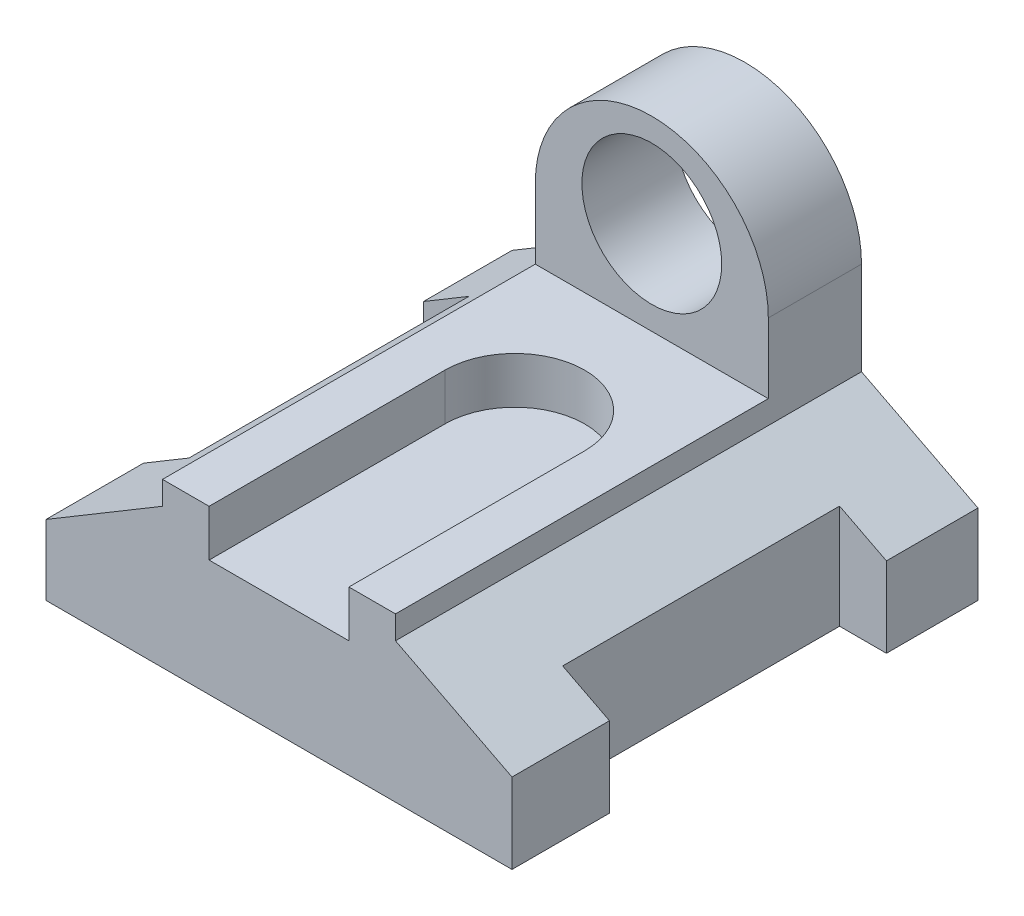
ISO-10303-21;
HEADER;
FILE_DESCRIPTION(('STEP AP214'),'2;1');
FILE_NAME('part.step','',(''),(''),'','','');
FILE_SCHEMA(('AUTOMOTIVE_DESIGN { 1 0 10303 214 1 1 1 1 }'));
ENDSEC;
DATA;
#1=APPLICATION_CONTEXT('core data for automotive mechanical design processes');
#2=APPLICATION_PROTOCOL_DEFINITION('international standard','automotive_design',2000,#1);
#3=PRODUCT_CONTEXT('',#1,'mechanical');
#4=PRODUCT('Part','Part','',(#3));
#5=PRODUCT_RELATED_PRODUCT_CATEGORY('part','',(#4));
#6=PRODUCT_DEFINITION_FORMATION('','',#4);
#7=PRODUCT_DEFINITION_CONTEXT('part definition',#1,'design');
#8=PRODUCT_DEFINITION('design','',#6,#7);
#9=PRODUCT_DEFINITION_SHAPE('','',#8);
#10=(LENGTH_UNIT() NAMED_UNIT(*) SI_UNIT(.MILLI.,.METRE.));
#11=(NAMED_UNIT(*) PLANE_ANGLE_UNIT() SI_UNIT($,.RADIAN.));
#12=(NAMED_UNIT(*) SI_UNIT($,.STERADIAN.) SOLID_ANGLE_UNIT());
#13=UNCERTAINTY_MEASURE_WITH_UNIT(LENGTH_MEASURE(1.E-05),#10,'distance_accuracy_value','');
#14=(GEOMETRIC_REPRESENTATION_CONTEXT(3) GLOBAL_UNCERTAINTY_ASSIGNED_CONTEXT((#13)) GLOBAL_UNIT_ASSIGNED_CONTEXT((#10,
#11,#12)) REPRESENTATION_CONTEXT('',''));
#15=CARTESIAN_POINT('',(0.,0.,0.));
#16=DIRECTION('',(0.,0.,1.));
#17=DIRECTION('',(1.,0.,0.));
#18=AXIS2_PLACEMENT_3D('',#15,#16,#17);
#19=CARTESIAN_POINT('',(63.7755102040816,9.43877551020408,100.));
#20=DIRECTION('',(-1.,0.,0.));
#21=DIRECTION('',(0.,-1.,0.));
#22=AXIS2_PLACEMENT_3D('',#19,#20,#21);
#23=PLANE('',#22);
#24=DIRECTION('',(0.,1.,0.));
#25=VECTOR('',#24,1.);
#26=CARTESIAN_POINT('',(63.7755102040816,9.43877551020408,0.));
#27=LINE('',#26,#25);
#28=CARTESIAN_POINT('',(63.7755102040816,-20.5612244897959,0.));
#29=VERTEX_POINT('',#28);
#30=CARTESIAN_POINT('',(63.7755102040816,-3.38012417465493,0.));
#31=VERTEX_POINT('',#30);
#32=EDGE_CURVE('E214',#29,#31,#27,.T.);
#33=ORIENTED_EDGE('',*,*,#32,.T.);
#34=DIRECTION('',(0.,0.,1.));
#35=VECTOR('',#34,1.);
#36=CARTESIAN_POINT('',(63.7755102040816,-3.38012417465493,100.));
#37=LINE('',#36,#35);
#38=CARTESIAN_POINT('',(63.7755102040816,-3.38012417465492,19.6515209700574));
#39=VERTEX_POINT('',#38);
#40=EDGE_CURVE('E267',#31,#39,#37,.T.);
#41=ORIENTED_EDGE('',*,*,#40,.T.);
#42=DIRECTION('',(0.,1.,0.));
#43=VECTOR('',#42,1.);
#44=CARTESIAN_POINT('',(63.7755102040816,-20.5612244897959,19.6515209700574));
#45=LINE('',#44,#43);
#46=CARTESIAN_POINT('',(63.7755102040816,-20.5612244897959,19.6515209700574));
#47=VERTEX_POINT('',#46);
#48=EDGE_CURVE('E269',#47,#39,#45,.T.);
#49=ORIENTED_EDGE('',*,*,#48,.F.);
#50=DIRECTION('',(0.,0.,-1.));
#51=VECTOR('',#50,1.);
#52=CARTESIAN_POINT('',(63.7755102040816,-20.5612244897959,100.));
#53=LINE('',#52,#51);
#54=EDGE_CURVE('E230',#47,#29,#53,.T.);
#55=ORIENTED_EDGE('',*,*,#54,.T.);
#56=EDGE_LOOP('',(#33,#41,#49,#55));
#57=FACE_BOUND('',#56,.T.);
#58=ADVANCED_FACE('F41',(#57),#23,.F.);
#59=DIRECTION('',(0.,1.,0.));
#60=VECTOR('',#59,1.);
#61=CARTESIAN_POINT('',(63.7755102040816,-20.5612244897959,79.0762357605909));
#62=LINE('',#61,#60);
#63=CARTESIAN_POINT('',(63.7755102040816,-20.5612244897959,79.0762357605909));
#64=VERTEX_POINT('',#63);
#65=CARTESIAN_POINT('',(63.7755102040816,-3.38012417465492,79.0762357605909));
#66=VERTEX_POINT('',#65);
#67=EDGE_CURVE('E285',#64,#66,#62,.T.);
#68=ORIENTED_EDGE('',*,*,#67,.T.);
#69=DIRECTION('',(0.,0.,1.));
#70=VECTOR('',#69,1.);
#71=CARTESIAN_POINT('',(63.7755102040816,-3.38012417465493,100.));
#72=LINE('',#71,#70);
#73=CARTESIAN_POINT('',(63.7755102040816,-3.38012417465493,100.));
#74=VERTEX_POINT('',#73);
#75=EDGE_CURVE('E460',#66,#74,#72,.T.);
#76=ORIENTED_EDGE('',*,*,#75,.T.);
#77=DIRECTION('',(0.,1.,0.));
#78=VECTOR('',#77,1.);
#79=CARTESIAN_POINT('',(63.7755102040816,9.43877551020408,100.));
#80=LINE('',#79,#78);
#81=CARTESIAN_POINT('',(63.7755102040816,-20.5612244897959,100.));
#82=VERTEX_POINT('',#81);
#83=EDGE_CURVE('E218',#82,#74,#80,.T.);
#84=ORIENTED_EDGE('',*,*,#83,.F.);
#85=EDGE_CURVE('E237',#82,#64,#53,.T.);
#86=ORIENTED_EDGE('',*,*,#85,.T.);
#87=EDGE_LOOP('',(#68,#76,#84,#86));
#88=FACE_BOUND('',#87,.T.);
#89=ADVANCED_FACE('F414',(#88),#23,.F.);
#90=CARTESIAN_POINT('',(0.,0.,100.));
#91=DIRECTION('',(0.,0.,1.));
#92=DIRECTION('',(1.,0.,0.));
#93=AXIS2_PLACEMENT_3D('',#90,#91,#92);
#94=PLANE('',#93);
#95=DIRECTION('',(0.85829371120847,0.513158752531799,0.));
#96=VECTOR('',#95,1.);
#97=CARTESIAN_POINT('',(-11.2244897959184,9.43877551020409,100.));
#98=LINE('',#97,#96);
#99=CARTESIAN_POINT('',(-36.2244897959184,-5.50828590450895,100.));
#100=VERTEX_POINT('',#99);
#101=CARTESIAN_POINT('',(-11.2244897959184,9.43877551020409,100.));
#102=VERTEX_POINT('',#101);
#103=EDGE_CURVE('E191',#100,#102,#98,.T.);
#104=ORIENTED_EDGE('',*,*,#103,.F.);
#105=DIRECTION('',(0.,-1.,0.));
#106=VECTOR('',#105,1.);
#107=CARTESIAN_POINT('',(-36.2244897959184,9.43877551020408,100.));
#108=LINE('',#107,#106);
#109=CARTESIAN_POINT('',(-36.2244897959184,-20.5612244897959,100.));
#110=VERTEX_POINT('',#109);
#111=EDGE_CURVE('E203',#100,#110,#108,.T.);
#112=ORIENTED_EDGE('',*,*,#111,.T.);
#113=DIRECTION('',(1.,0.,0.));
#114=VECTOR('',#113,1.);
#115=CARTESIAN_POINT('',(-36.2244897959184,-20.5612244897959,100.));
#116=LINE('',#115,#114);
#117=EDGE_CURVE('E213',#110,#82,#116,.T.);
#118=ORIENTED_EDGE('',*,*,#117,.T.);
#119=ORIENTED_EDGE('',*,*,#83,.T.);
#120=DIRECTION('',(0.889840775309432,-0.456271185367551,0.));
#121=VECTOR('',#120,1.);
#122=CARTESIAN_POINT('',(67.925947804369,-5.50828590450895,100.));
#123=LINE('',#122,#121);
#124=CARTESIAN_POINT('',(38.7755102040816,9.43877551020408,100.));
#125=VERTEX_POINT('',#124);
#126=EDGE_CURVE('E208',#125,#74,#123,.T.);
#127=ORIENTED_EDGE('',*,*,#126,.F.);
#128=DIRECTION('',(0.,1.,0.));
#129=VECTOR('',#128,1.);
#130=CARTESIAN_POINT('',(38.7755102040816,0.,100.));
#131=LINE('',#130,#129);
#132=CARTESIAN_POINT('',(38.7755102040816,14.4387755102041,100.));
#133=VERTEX_POINT('',#132);
#134=EDGE_CURVE('E356',#125,#133,#131,.T.);
#135=ORIENTED_EDGE('',*,*,#134,.T.);
#136=DIRECTION('',(-1.,0.,0.));
#137=VECTOR('',#136,1.);
#138=CARTESIAN_POINT('',(0.,14.4387755102041,100.));
#139=LINE('',#138,#137);
#140=CARTESIAN_POINT('',(28.7755102040816,14.4387755102041,100.));
#141=VERTEX_POINT('',#140);
#142=EDGE_CURVE('E362',#133,#141,#139,.T.);
#143=ORIENTED_EDGE('',*,*,#142,.T.);
#144=DIRECTION('',(0.,1.,0.));
#145=VECTOR('',#144,1.);
#146=CARTESIAN_POINT('',(28.7755102040816,4.43877551020409,100.));
#147=LINE('',#146,#145);
#148=CARTESIAN_POINT('',(28.7755102040816,4.43877551020409,100.));
#149=VERTEX_POINT('',#148);
#150=EDGE_CURVE('E499',#149,#141,#147,.T.);
#151=ORIENTED_EDGE('',*,*,#150,.F.);
#152=DIRECTION('',(1.,0.,0.));
#153=VECTOR('',#152,1.);
#154=CARTESIAN_POINT('',(0.,4.43877551020409,100.));
#155=LINE('',#154,#153);
#156=CARTESIAN_POINT('',(-1.22448979591837,4.43877551020409,100.));
#157=VERTEX_POINT('',#156);
#158=EDGE_CURVE('E479',#157,#149,#155,.T.);
#159=ORIENTED_EDGE('',*,*,#158,.F.);
#160=DIRECTION('',(0.,1.,0.));
#161=VECTOR('',#160,1.);
#162=CARTESIAN_POINT('',(-1.22448979591837,4.43877551020409,100.));
#163=LINE('',#162,#161);
#164=CARTESIAN_POINT('',(-1.22448979591837,14.4387755102041,100.));
#165=VERTEX_POINT('',#164);
#166=EDGE_CURVE('E502',#157,#165,#163,.T.);
#167=ORIENTED_EDGE('',*,*,#166,.T.);
#168=CARTESIAN_POINT('',(-11.2244897959184,14.4387755102041,100.));
#169=VERTEX_POINT('',#168);
#170=EDGE_CURVE('E360',#165,#169,#139,.T.);
#171=ORIENTED_EDGE('',*,*,#170,.T.);
#172=DIRECTION('',(0.,1.,0.));
#173=VECTOR('',#172,1.);
#174=CARTESIAN_POINT('',(-11.2244897959184,0.,100.));
#175=LINE('',#174,#173);
#176=EDGE_CURVE('E206',#102,#169,#175,.T.);
#177=ORIENTED_EDGE('',*,*,#176,.F.);
#178=EDGE_LOOP('',(#104,#112,#118,#119,#127,#135,#143,#151,#159,#167,#171,#177));
#179=FACE_BOUND('',#178,.T.);
#180=ADVANCED_FACE('F202',(#179),#94,.T.);
#181=CARTESIAN_POINT('',(0.,0.,0.));
#182=DIRECTION('',(0.,0.,1.));
#183=DIRECTION('',(1.,0.,0.));
#184=AXIS2_PLACEMENT_3D('',#181,#182,#183);
#185=PLANE('',#184);
#186=CARTESIAN_POINT('',(13.7755102040816,34.4387755102041,0.));
#187=DIRECTION('',(0.,0.,1.));
#188=DIRECTION('',(1.,0.,0.));
#189=AXIS2_PLACEMENT_3D('',#186,#187,#188);
#190=CIRCLE('',#189,15.);
#191=CARTESIAN_POINT('',(28.7755102040816,34.4387755102041,0.));
#192=VERTEX_POINT('',#191);
#193=EDGE_CURVE('E322',#192,#192,#190,.T.);
#194=ORIENTED_EDGE('',*,*,#193,.T.);
#195=EDGE_LOOP('',(#194));
#196=FACE_BOUND('',#195,.T.);
#197=DIRECTION('',(0.,-1.,0.));
#198=VECTOR('',#197,1.);
#199=CARTESIAN_POINT('',(-36.2244897959184,9.43877551020408,0.));
#200=LINE('',#199,#198);
#201=CARTESIAN_POINT('',(-36.2244897959184,-5.50828590450895,0.));
#202=VERTEX_POINT('',#201);
#203=CARTESIAN_POINT('',(-36.2244897959184,-20.5612244897959,0.));
#204=VERTEX_POINT('',#203);
#205=EDGE_CURVE('E231',#202,#204,#200,.T.);
#206=ORIENTED_EDGE('',*,*,#205,.F.);
#207=DIRECTION('',(0.85829371120847,0.513158752531799,0.));
#208=VECTOR('',#207,1.);
#209=CARTESIAN_POINT('',(-7.11298934916731,11.8969694975724,0.));
#210=LINE('',#209,#208);
#211=CARTESIAN_POINT('',(-11.2244897959184,9.43877551020409,0.));
#212=VERTEX_POINT('',#211);
#213=EDGE_CURVE('E444',#202,#212,#210,.T.);
#214=ORIENTED_EDGE('',*,*,#213,.T.);
#215=DIRECTION('',(0.,1.,0.));
#216=VECTOR('',#215,1.);
#217=CARTESIAN_POINT('',(-11.2244897959184,0.,0.));
#218=LINE('',#217,#216);
#219=CARTESIAN_POINT('',(-11.2244897959184,29.4387755102041,0.));
#220=VERTEX_POINT('',#219);
#221=EDGE_CURVE('E361',#212,#220,#218,.T.);
#222=ORIENTED_EDGE('',*,*,#221,.T.);
#223=CARTESIAN_POINT('',(13.7755102040816,29.4387755102041,0.));
#224=DIRECTION('',(0.,0.,1.));
#225=DIRECTION('',(-1.,0.,0.));
#226=AXIS2_PLACEMENT_3D('',#223,#224,#225);
#227=CIRCLE('',#226,25.);
#228=CARTESIAN_POINT('',(38.7755102040816,29.4387755102041,0.));
#229=VERTEX_POINT('',#228);
#230=EDGE_CURVE('E326',#229,#220,#227,.T.);
#231=ORIENTED_EDGE('',*,*,#230,.F.);
#232=DIRECTION('',(0.,1.,0.));
#233=VECTOR('',#232,1.);
#234=CARTESIAN_POINT('',(38.7755102040816,0.,0.));
#235=LINE('',#234,#233);
#236=CARTESIAN_POINT('',(38.7755102040816,9.43877551020408,0.));
#237=VERTEX_POINT('',#236);
#238=EDGE_CURVE('E355',#237,#229,#235,.T.);
#239=ORIENTED_EDGE('',*,*,#238,.F.);
#240=DIRECTION('',(0.889840775309432,-0.456271185367551,0.));
#241=VECTOR('',#240,1.);
#242=CARTESIAN_POINT('',(11.9046423663867,23.2169738804647,0.));
#243=LINE('',#242,#241);
#244=EDGE_CURVE('E263',#237,#31,#243,.T.);
#245=ORIENTED_EDGE('',*,*,#244,.T.);
#246=ORIENTED_EDGE('',*,*,#32,.F.);
#247=DIRECTION('',(1.,0.,0.));
#248=VECTOR('',#247,1.);
#249=CARTESIAN_POINT('',(-36.2244897959184,-20.5612244897959,0.));
#250=LINE('',#249,#248);
#251=EDGE_CURVE('E221',#204,#29,#250,.T.);
#252=ORIENTED_EDGE('',*,*,#251,.F.);
#253=EDGE_LOOP('',(#206,#214,#222,#231,#239,#245,#246,#252));
#254=FACE_BOUND('',#253,.T.);
#255=ADVANCED_FACE('F259',(#196,#254),#185,.F.);
#256=CARTESIAN_POINT('',(53.7220228304721,-20.5612244897959,0.));
#257=DIRECTION('',(-1.,0.,0.));
#258=DIRECTION('',(0.,0.,1.));
#259=AXIS2_PLACEMENT_3D('',#256,#257,#258);
#260=PLANE('',#259);
#261=DIRECTION('',(0.,1.,0.));
#262=VECTOR('',#261,1.);
#263=CARTESIAN_POINT('',(53.7220228304721,-20.5612244897959,19.6515209700574));
#264=LINE('',#263,#262);
#265=CARTESIAN_POINT('',(53.7220228304721,-20.5612244897959,19.6515209700574));
#266=VERTEX_POINT('',#265);
#267=CARTESIAN_POINT('',(53.7220228304721,1.77486167035694,19.6515209700574));
#268=VERTEX_POINT('',#267);
#269=EDGE_CURVE('E290',#266,#268,#264,.T.);
#270=ORIENTED_EDGE('',*,*,#269,.T.);
#271=DIRECTION('',(0.,0.,1.));
#272=VECTOR('',#271,1.);
#273=CARTESIAN_POINT('',(53.7220228304721,1.77486167035694,0.));
#274=LINE('',#273,#272);
#275=CARTESIAN_POINT('',(53.7220228304721,1.77486167035695,79.0762357605909));
#276=VERTEX_POINT('',#275);
#277=EDGE_CURVE('E456',#268,#276,#274,.T.);
#278=ORIENTED_EDGE('',*,*,#277,.T.);
#279=DIRECTION('',(0.,1.,0.));
#280=VECTOR('',#279,1.);
#281=CARTESIAN_POINT('',(53.7220228304721,-20.5612244897959,79.0762357605909));
#282=LINE('',#281,#280);
#283=CARTESIAN_POINT('',(53.7220228304721,-20.5612244897959,79.0762357605909));
#284=VERTEX_POINT('',#283);
#285=EDGE_CURVE('E279',#284,#276,#282,.T.);
#286=ORIENTED_EDGE('',*,*,#285,.F.);
#287=DIRECTION('',(0.,0.,1.));
#288=VECTOR('',#287,1.);
#289=CARTESIAN_POINT('',(53.7220228304721,-20.5612244897959,0.));
#290=LINE('',#289,#288);
#291=EDGE_CURVE('E276',#266,#284,#290,.T.);
#292=ORIENTED_EDGE('',*,*,#291,.F.);
#293=EDGE_LOOP('',(#270,#278,#286,#292));
#294=FACE_BOUND('',#293,.T.);
#295=ADVANCED_FACE('F532',(#294),#260,.F.);
#296=CARTESIAN_POINT('',(0.,-20.5612244897959,19.6515209700574));
#297=DIRECTION('',(0.,0.,-1.));
#298=DIRECTION('',(-1.,0.,0.));
#299=AXIS2_PLACEMENT_3D('',#296,#297,#298);
#300=PLANE('',#299);
#301=ORIENTED_EDGE('',*,*,#48,.T.);
#302=DIRECTION('',(-0.889840775309432,0.456271185367551,0.));
#303=VECTOR('',#302,1.);
#304=CARTESIAN_POINT('',(20.2526785016695,18.936468369114,19.6515209700574));
#305=LINE('',#304,#303);
#306=EDGE_CURVE('E464',#39,#268,#305,.T.);
#307=ORIENTED_EDGE('',*,*,#306,.T.);
#308=ORIENTED_EDGE('',*,*,#269,.F.);
#309=DIRECTION('',(-1.,0.,0.));
#310=VECTOR('',#309,1.);
#311=CARTESIAN_POINT('',(0.,-20.5612244897959,19.6515209700574));
#312=LINE('',#311,#310);
#313=EDGE_CURVE('E273',#47,#266,#312,.T.);
#314=ORIENTED_EDGE('',*,*,#313,.F.);
#315=EDGE_LOOP('',(#301,#307,#308,#314));
#316=FACE_BOUND('',#315,.T.);
#317=ADVANCED_FACE('F435',(#316),#300,.F.);
#318=CARTESIAN_POINT('',(0.,-20.5612244897959,79.0762357605909));
#319=DIRECTION('',(0.,0.,1.));
#320=DIRECTION('',(1.,0.,0.));
#321=AXIS2_PLACEMENT_3D('',#318,#319,#320);
#322=PLANE('',#321);
#323=ORIENTED_EDGE('',*,*,#285,.T.);
#324=DIRECTION('',(0.889840775309432,-0.456271185367551,0.));
#325=VECTOR('',#324,1.);
#326=CARTESIAN_POINT('',(20.2526785016695,18.936468369114,79.0762357605909));
#327=LINE('',#326,#325);
#328=EDGE_CURVE('E448',#276,#66,#327,.T.);
#329=ORIENTED_EDGE('',*,*,#328,.T.);
#330=ORIENTED_EDGE('',*,*,#67,.F.);
#331=DIRECTION('',(1.,0.,0.));
#332=VECTOR('',#331,1.);
#333=CARTESIAN_POINT('',(0.,-20.5612244897959,79.0762357605909));
#334=LINE('',#333,#332);
#335=EDGE_CURVE('E280',#284,#64,#334,.T.);
#336=ORIENTED_EDGE('',*,*,#335,.F.);
#337=EDGE_LOOP('',(#323,#329,#330,#336));
#338=FACE_BOUND('',#337,.T.);
#339=ADVANCED_FACE('F431',(#338),#322,.F.);
#340=CARTESIAN_POINT('',(-36.2244897959184,9.43877551020408,100.));
#341=DIRECTION('',(1.,0.,0.));
#342=DIRECTION('',(0.,1.,0.));
#343=AXIS2_PLACEMENT_3D('',#340,#341,#342);
#344=PLANE('',#343);
#345=DIRECTION('',(0.,1.,0.));
#346=VECTOR('',#345,1.);
#347=CARTESIAN_POINT('',(-36.2244897959184,-20.5612244897959,18.9953724311174));
#348=LINE('',#347,#346);
#349=CARTESIAN_POINT('',(-36.2244897959184,-20.5612244897959,18.9953724311174));
#350=VERTEX_POINT('',#349);
#351=CARTESIAN_POINT('',(-36.2244897959184,-5.50828590450895,18.9953724311174));
#352=VERTEX_POINT('',#351);
#353=EDGE_CURVE('E307',#350,#352,#348,.T.);
#354=ORIENTED_EDGE('',*,*,#353,.T.);
#355=DIRECTION('',(0.,0.,1.));
#356=VECTOR('',#355,1.);
#357=CARTESIAN_POINT('',(-36.2244897959184,-5.50828590450895,-30.));
#358=LINE('',#357,#356);
#359=EDGE_CURVE('E198',#202,#352,#358,.T.);
#360=ORIENTED_EDGE('',*,*,#359,.F.);
#361=ORIENTED_EDGE('',*,*,#205,.T.);
#362=DIRECTION('',(0.,0.,-1.));
#363=VECTOR('',#362,1.);
#364=CARTESIAN_POINT('',(-36.2244897959184,-20.5612244897959,100.));
#365=LINE('',#364,#363);
#366=EDGE_CURVE('E240',#350,#204,#365,.T.);
#367=ORIENTED_EDGE('',*,*,#366,.F.);
#368=EDGE_LOOP('',(#354,#360,#361,#367));
#369=FACE_BOUND('',#368,.T.);
#370=ADVANCED_FACE('F426',(#369),#344,.F.);
#371=CARTESIAN_POINT('',(0.,14.4387755102041,100.));
#372=DIRECTION('',(0.,-1.,0.));
#373=DIRECTION('',(0.,0.,-1.));
#374=AXIS2_PLACEMENT_3D('',#371,#372,#373);
#375=PLANE('',#374);
#376=CARTESIAN_POINT('',(13.7755102040816,14.4387755102041,49.395873987919));
#377=DIRECTION('',(0.,1.,0.));
#378=DIRECTION('',(0.,0.,1.));
#379=AXIS2_PLACEMENT_3D('',#376,#377,#378);
#380=CIRCLE('',#379,15.);
#381=CARTESIAN_POINT('',(-1.22448979591837,14.4387755102041,49.395873987919));
#382=VERTEX_POINT('',#381);
#383=CARTESIAN_POINT('',(28.7755102040816,14.4387755102041,49.395873987919));
#384=VERTEX_POINT('',#383);
#385=EDGE_CURVE('E472',#382,#384,#380,.F.);
#386=ORIENTED_EDGE('',*,*,#385,.T.);
#387=DIRECTION('',(0.,0.,-1.));
#388=VECTOR('',#387,1.);
#389=CARTESIAN_POINT('',(28.7755102040816,14.4387755102041,0.));
#390=LINE('',#389,#388);
#391=EDGE_CURVE('E476',#141,#384,#390,.T.);
#392=ORIENTED_EDGE('',*,*,#391,.F.);
#393=ORIENTED_EDGE('',*,*,#142,.F.);
#394=DIRECTION('',(0.,0.,-1.));
#395=VECTOR('',#394,1.);
#396=CARTESIAN_POINT('',(38.7755102040816,14.4387755102041,100.));
#397=LINE('',#396,#395);
#398=CARTESIAN_POINT('',(38.7755102040816,14.4387755102041,20.));
#399=VERTEX_POINT('',#398);
#400=EDGE_CURVE('E224',#133,#399,#397,.T.);
#401=ORIENTED_EDGE('',*,*,#400,.T.);
#402=DIRECTION('',(1.,0.,0.));
#403=VECTOR('',#402,1.);
#404=CARTESIAN_POINT('',(-11.2244897959184,14.4387755102041,20.));
#405=LINE('',#404,#403);
#406=CARTESIAN_POINT('',(-11.2244897959184,14.4387755102041,20.));
#407=VERTEX_POINT('',#406);
#408=EDGE_CURVE('E334',#407,#399,#405,.T.);
#409=ORIENTED_EDGE('',*,*,#408,.F.);
#410=DIRECTION('',(0.,0.,-1.));
#411=VECTOR('',#410,1.);
#412=CARTESIAN_POINT('',(-11.2244897959184,14.4387755102041,100.));
#413=LINE('',#412,#411);
#414=EDGE_CURVE('E378',#169,#407,#413,.T.);
#415=ORIENTED_EDGE('',*,*,#414,.F.);
#416=ORIENTED_EDGE('',*,*,#170,.F.);
#417=DIRECTION('',(0.,0.,-1.));
#418=VECTOR('',#417,1.);
#419=CARTESIAN_POINT('',(-1.22448979591837,14.4387755102041,0.));
#420=LINE('',#419,#418);
#421=EDGE_CURVE('E489',#165,#382,#420,.T.);
#422=ORIENTED_EDGE('',*,*,#421,.T.);
#423=EDGE_LOOP('',(#386,#392,#393,#401,#409,#415,#416,#422));
#424=FACE_BOUND('',#423,.T.);
#425=ADVANCED_FACE('F388',(#424),#375,.F.);
#426=ORIENTED_EDGE('',*,*,#111,.F.);
#427=CARTESIAN_POINT('',(-36.2244897959184,-5.50828590450895,79.0762357605909));
#428=VERTEX_POINT('',#427);
#429=EDGE_CURVE('E188',#428,#100,#358,.T.);
#430=ORIENTED_EDGE('',*,*,#429,.F.);
#431=DIRECTION('',(0.,1.,0.));
#432=VECTOR('',#431,1.);
#433=CARTESIAN_POINT('',(-36.2244897959184,-20.5612244897959,79.0762357605909));
#434=LINE('',#433,#432);
#435=CARTESIAN_POINT('',(-36.2244897959184,-20.5612244897959,79.0762357605909));
#436=VERTEX_POINT('',#435);
#437=EDGE_CURVE('E317',#436,#428,#434,.T.);
#438=ORIENTED_EDGE('',*,*,#437,.F.);
#439=EDGE_CURVE('E50',#110,#436,#365,.T.);
#440=ORIENTED_EDGE('',*,*,#439,.F.);
#441=EDGE_LOOP('',(#426,#430,#438,#440));
#442=FACE_BOUND('',#441,.T.);
#443=ADVANCED_FACE('F43',(#442),#344,.F.);
#444=CARTESIAN_POINT('',(-36.2244897959184,-20.5612244897959,100.));
#445=DIRECTION('',(0.,1.,0.));
#446=DIRECTION('',(0.,0.,1.));
#447=AXIS2_PLACEMENT_3D('',#444,#445,#446);
#448=PLANE('',#447);
#449=ORIENTED_EDGE('',*,*,#54,.F.);
#450=ORIENTED_EDGE('',*,*,#313,.T.);
#451=ORIENTED_EDGE('',*,*,#291,.T.);
#452=ORIENTED_EDGE('',*,*,#335,.T.);
#453=ORIENTED_EDGE('',*,*,#85,.F.);
#454=ORIENTED_EDGE('',*,*,#117,.F.);
#455=ORIENTED_EDGE('',*,*,#439,.T.);
#456=DIRECTION('',(1.,0.,0.));
#457=VECTOR('',#456,1.);
#458=CARTESIAN_POINT('',(-36.2244897959184,-20.5612244897959,79.0762357605909));
#459=LINE('',#458,#457);
#460=CARTESIAN_POINT('',(-26.4701524690782,-20.5612244897959,79.0762357605909));
#461=VERTEX_POINT('',#460);
#462=EDGE_CURVE('E301',#436,#461,#459,.T.);
#463=ORIENTED_EDGE('',*,*,#462,.T.);
#464=DIRECTION('',(0.,0.,-1.));
#465=VECTOR('',#464,1.);
#466=CARTESIAN_POINT('',(-26.4701524690782,-20.5612244897959,79.0762357605909));
#467=LINE('',#466,#465);
#468=CARTESIAN_POINT('',(-26.4701524690782,-20.5612244897959,18.9953724311174));
#469=VERTEX_POINT('',#468);
#470=EDGE_CURVE('E304',#461,#469,#467,.T.);
#471=ORIENTED_EDGE('',*,*,#470,.T.);
#472=DIRECTION('',(-1.,0.,0.));
#473=VECTOR('',#472,1.);
#474=CARTESIAN_POINT('',(-26.4701524690782,-20.5612244897959,18.9953724311174));
#475=LINE('',#474,#473);
#476=EDGE_CURVE('E254',#469,#350,#475,.T.);
#477=ORIENTED_EDGE('',*,*,#476,.T.);
#478=ORIENTED_EDGE('',*,*,#366,.T.);
#479=ORIENTED_EDGE('',*,*,#251,.T.);
#480=EDGE_LOOP('',(#449,#450,#451,#452,#453,#454,#455,#463,#471,#477,#478,#479));
#481=FACE_BOUND('',#480,.T.);
#482=ADVANCED_FACE('F250',(#481),#448,.F.);
#483=CARTESIAN_POINT('',(38.7755102040816,0.,100.));
#484=DIRECTION('',(-1.,0.,0.));
#485=DIRECTION('',(0.,0.,1.));
#486=AXIS2_PLACEMENT_3D('',#483,#484,#485);
#487=PLANE('',#486);
#488=ORIENTED_EDGE('',*,*,#238,.T.);
#489=DIRECTION('',(0.,0.,-1.));
#490=VECTOR('',#489,1.);
#491=CARTESIAN_POINT('',(38.7755102040816,29.4387755102041,20.));
#492=LINE('',#491,#490);
#493=CARTESIAN_POINT('',(38.7755102040816,29.4387755102041,20.));
#494=VERTEX_POINT('',#493);
#495=EDGE_CURVE('E351',#494,#229,#492,.T.);
#496=ORIENTED_EDGE('',*,*,#495,.F.);
#497=DIRECTION('',(0.,1.,0.));
#498=VECTOR('',#497,1.);
#499=CARTESIAN_POINT('',(38.7755102040816,14.4387755102041,20.));
#500=LINE('',#499,#498);
#501=EDGE_CURVE('E338',#399,#494,#500,.T.);
#502=ORIENTED_EDGE('',*,*,#501,.F.);
#503=ORIENTED_EDGE('',*,*,#400,.F.);
#504=ORIENTED_EDGE('',*,*,#134,.F.);
#505=DIRECTION('',(0.,0.,-1.));
#506=VECTOR('',#505,1.);
#507=CARTESIAN_POINT('',(38.7755102040816,9.43877551020408,100.));
#508=LINE('',#507,#506);
#509=EDGE_CURVE('E368',#125,#237,#508,.T.);
#510=ORIENTED_EDGE('',*,*,#509,.T.);
#511=EDGE_LOOP('',(#488,#496,#502,#503,#504,#510));
#512=FACE_BOUND('',#511,.T.);
#513=ADVANCED_FACE('F396',(#512),#487,.F.);
#514=CARTESIAN_POINT('',(-11.2244897959184,0.,100.));
#515=DIRECTION('',(-1.,0.,0.));
#516=DIRECTION('',(0.,0.,1.));
#517=AXIS2_PLACEMENT_3D('',#514,#515,#516);
#518=PLANE('',#517);
#519=ORIENTED_EDGE('',*,*,#221,.F.);
#520=DIRECTION('',(0.,0.,-1.));
#521=VECTOR('',#520,1.);
#522=CARTESIAN_POINT('',(-11.2244897959184,9.43877551020409,100.));
#523=LINE('',#522,#521);
#524=EDGE_CURVE('E376',#102,#212,#523,.T.);
#525=ORIENTED_EDGE('',*,*,#524,.F.);
#526=ORIENTED_EDGE('',*,*,#176,.T.);
#527=ORIENTED_EDGE('',*,*,#414,.T.);
#528=DIRECTION('',(0.,-1.,0.));
#529=VECTOR('',#528,1.);
#530=CARTESIAN_POINT('',(-11.2244897959184,14.4387755102041,20.));
#531=LINE('',#530,#529);
#532=CARTESIAN_POINT('',(-11.2244897959184,29.4387755102041,20.));
#533=VERTEX_POINT('',#532);
#534=EDGE_CURVE('E330',#533,#407,#531,.T.);
#535=ORIENTED_EDGE('',*,*,#534,.F.);
#536=DIRECTION('',(0.,0.,-1.));
#537=VECTOR('',#536,1.);
#538=CARTESIAN_POINT('',(-11.2244897959184,29.4387755102041,20.));
#539=LINE('',#538,#537);
#540=EDGE_CURVE('E344',#533,#220,#539,.T.);
#541=ORIENTED_EDGE('',*,*,#540,.T.);
#542=EDGE_LOOP('',(#519,#525,#526,#527,#535,#541));
#543=FACE_BOUND('',#542,.T.);
#544=ADVANCED_FACE('F403',(#543),#518,.T.);
#545=CARTESIAN_POINT('',(13.7755102040816,29.4387755102041,20.));
#546=DIRECTION('',(0.,0.,-1.));
#547=DIRECTION('',(-1.,0.,0.));
#548=AXIS2_PLACEMENT_3D('',#545,#546,#547);
#549=CYLINDRICAL_SURFACE('',#548,25.);
#550=ORIENTED_EDGE('',*,*,#230,.T.);
#551=ORIENTED_EDGE('',*,*,#540,.F.);
#552=CARTESIAN_POINT('',(13.7755102040816,29.4387755102041,20.));
#553=DIRECTION('',(0.,0.,1.));
#554=DIRECTION('',(-1.,0.,0.));
#555=AXIS2_PLACEMENT_3D('',#552,#553,#554);
#556=CIRCLE('',#555,25.);
#557=EDGE_CURVE('E341',#494,#533,#556,.T.);
#558=ORIENTED_EDGE('',*,*,#557,.F.);
#559=ORIENTED_EDGE('',*,*,#495,.T.);
#560=EDGE_LOOP('',(#550,#551,#558,#559));
#561=FACE_BOUND('',#560,.T.);
#562=ADVANCED_FACE('F401',(#561),#549,.T.);
#563=CARTESIAN_POINT('',(13.7755102040816,29.4387755102041,20.));
#564=DIRECTION('',(0.,0.,-1.));
#565=DIRECTION('',(-1.,0.,0.));
#566=AXIS2_PLACEMENT_3D('',#563,#564,#565);
#567=PLANE('',#566);
#568=CARTESIAN_POINT('',(13.7755102040816,34.4387755102041,20.));
#569=DIRECTION('',(0.,0.,1.));
#570=DIRECTION('',(1.,0.,0.));
#571=AXIS2_PLACEMENT_3D('',#568,#569,#570);
#572=CIRCLE('',#571,15.);
#573=CARTESIAN_POINT('',(28.7755102040816,34.4387755102041,20.));
#574=VERTEX_POINT('',#573);
#575=EDGE_CURVE('E312',#574,#574,#572,.T.);
#576=ORIENTED_EDGE('',*,*,#575,.F.);
#577=EDGE_LOOP('',(#576));
#578=FACE_BOUND('',#577,.T.);
#579=ORIENTED_EDGE('',*,*,#534,.T.);
#580=ORIENTED_EDGE('',*,*,#408,.T.);
#581=ORIENTED_EDGE('',*,*,#501,.T.);
#582=ORIENTED_EDGE('',*,*,#557,.T.);
#583=EDGE_LOOP('',(#579,#580,#581,#582));
#584=FACE_BOUND('',#583,.T.);
#585=ADVANCED_FACE('F394',(#578,#584),#567,.F.);
#586=CARTESIAN_POINT('',(13.7755102040816,34.4387755102041,0.));
#587=DIRECTION('',(0.,0.,1.));
#588=DIRECTION('',(1.,0.,0.));
#589=AXIS2_PLACEMENT_3D('',#586,#587,#588);
#590=CYLINDRICAL_SURFACE('',#589,15.);
#591=ORIENTED_EDGE('',*,*,#193,.F.);
#592=EDGE_LOOP('',(#591));
#593=FACE_BOUND('',#592,.T.);
#594=ORIENTED_EDGE('',*,*,#575,.T.);
#595=EDGE_LOOP('',(#594));
#596=FACE_BOUND('',#595,.T.);
#597=ADVANCED_FACE('F552',(#593,#596),#590,.F.);
#598=CARTESIAN_POINT('',(-26.4701524690782,-20.5612244897959,18.9953724311174));
#599=DIRECTION('',(0.,0.,-1.));
#600=DIRECTION('',(-1.,0.,0.));
#601=AXIS2_PLACEMENT_3D('',#598,#599,#600);
#602=PLANE('',#601);
#603=DIRECTION('',(0.,1.,0.));
#604=VECTOR('',#603,1.);
#605=CARTESIAN_POINT('',(-26.4701524690782,-20.5612244897959,18.9953724311174));
#606=LINE('',#605,#604);
#607=CARTESIAN_POINT('',(-26.4701524690782,0.323661258855367,18.9953724311174));
#608=VERTEX_POINT('',#607);
#609=EDGE_CURVE('E308',#469,#608,#606,.T.);
#610=ORIENTED_EDGE('',*,*,#609,.T.);
#611=DIRECTION('',(-0.85829371120847,-0.513158752531799,0.));
#612=VECTOR('',#611,1.);
#613=CARTESIAN_POINT('',(-35.6687109742828,-5.17599549730963,18.9953724311174));
#614=LINE('',#613,#612);
#615=EDGE_CURVE('E442',#608,#352,#614,.T.);
#616=ORIENTED_EDGE('',*,*,#615,.T.);
#617=ORIENTED_EDGE('',*,*,#353,.F.);
#618=ORIENTED_EDGE('',*,*,#476,.F.);
#619=EDGE_LOOP('',(#610,#616,#617,#618));
#620=FACE_BOUND('',#619,.T.);
#621=ADVANCED_FACE('F441',(#620),#602,.F.);
#622=CARTESIAN_POINT('',(-26.4701524690782,-20.5612244897959,79.0762357605909));
#623=DIRECTION('',(1.,0.,0.));
#624=DIRECTION('',(0.,0.,-1.));
#625=AXIS2_PLACEMENT_3D('',#622,#623,#624);
#626=PLANE('',#625);
#627=DIRECTION('',(0.,1.,0.));
#628=VECTOR('',#627,1.);
#629=CARTESIAN_POINT('',(-26.4701524690782,-20.5612244897959,79.0762357605909));
#630=LINE('',#629,#628);
#631=CARTESIAN_POINT('',(-26.4701524690782,0.323661258855366,79.0762357605909));
#632=VERTEX_POINT('',#631);
#633=EDGE_CURVE('E313',#461,#632,#630,.T.);
#634=ORIENTED_EDGE('',*,*,#633,.T.);
#635=DIRECTION('',(0.,0.,-1.));
#636=VECTOR('',#635,1.);
#637=CARTESIAN_POINT('',(-26.4701524690782,0.323661258855367,79.0762357605909));
#638=LINE('',#637,#636);
#639=EDGE_CURVE('E57',#632,#608,#638,.T.);
#640=ORIENTED_EDGE('',*,*,#639,.T.);
#641=ORIENTED_EDGE('',*,*,#609,.F.);
#642=ORIENTED_EDGE('',*,*,#470,.F.);
#643=EDGE_LOOP('',(#634,#640,#641,#642));
#644=FACE_BOUND('',#643,.T.);
#645=ADVANCED_FACE('F542',(#644),#626,.F.);
#646=CARTESIAN_POINT('',(-36.2244897959184,-20.5612244897959,79.0762357605909));
#647=DIRECTION('',(0.,0.,1.));
#648=DIRECTION('',(1.,0.,0.));
#649=AXIS2_PLACEMENT_3D('',#646,#647,#648);
#650=PLANE('',#649);
#651=ORIENTED_EDGE('',*,*,#437,.T.);
#652=DIRECTION('',(0.85829371120847,0.513158752531799,0.));
#653=VECTOR('',#652,1.);
#654=CARTESIAN_POINT('',(-42.8544200679074,-9.47220490253634,79.0762357605909));
#655=LINE('',#654,#653);
#656=EDGE_CURVE('E11',#428,#632,#655,.T.);
#657=ORIENTED_EDGE('',*,*,#656,.T.);
#658=ORIENTED_EDGE('',*,*,#633,.F.);
#659=ORIENTED_EDGE('',*,*,#462,.F.);
#660=EDGE_LOOP('',(#651,#657,#658,#659));
#661=FACE_BOUND('',#660,.T.);
#662=ADVANCED_FACE('F545',(#661),#650,.F.);
#663=CARTESIAN_POINT('',(13.7755102040816,4.43877551020409,49.395873987919));
#664=DIRECTION('',(0.,1.,0.));
#665=DIRECTION('',(0.,0.,1.));
#666=AXIS2_PLACEMENT_3D('',#663,#664,#665);
#667=CYLINDRICAL_SURFACE('',#666,15.);
#668=ORIENTED_EDGE('',*,*,#385,.F.);
#669=DIRECTION('',(0.,1.,0.));
#670=VECTOR('',#669,1.);
#671=CARTESIAN_POINT('',(-1.22448979591837,4.43877551020409,49.395873987919));
#672=LINE('',#671,#670);
#673=CARTESIAN_POINT('',(-1.22448979591837,4.43877551020409,49.395873987919));
#674=VERTEX_POINT('',#673);
#675=EDGE_CURVE('E486',#674,#382,#672,.T.);
#676=ORIENTED_EDGE('',*,*,#675,.F.);
#677=CARTESIAN_POINT('',(13.7755102040816,4.43877551020409,49.395873987919));
#678=DIRECTION('',(0.,1.,0.));
#679=DIRECTION('',(0.,0.,1.));
#680=AXIS2_PLACEMENT_3D('',#677,#678,#679);
#681=CIRCLE('',#680,15.);
#682=CARTESIAN_POINT('',(28.7755102040816,4.43877551020409,49.395873987919));
#683=VERTEX_POINT('',#682);
#684=EDGE_CURVE('E473',#674,#683,#681,.F.);
#685=ORIENTED_EDGE('',*,*,#684,.T.);
#686=DIRECTION('',(0.,1.,0.));
#687=VECTOR('',#686,1.);
#688=CARTESIAN_POINT('',(28.7755102040816,4.43877551020409,49.395873987919));
#689=LINE('',#688,#687);
#690=EDGE_CURVE('E496',#683,#384,#689,.T.);
#691=ORIENTED_EDGE('',*,*,#690,.T.);
#692=EDGE_LOOP('',(#668,#676,#685,#691));
#693=FACE_BOUND('',#692,.T.);
#694=ADVANCED_FACE('F513',(#693),#667,.F.);
#695=CARTESIAN_POINT('',(28.7755102040816,4.43877551020409,0.));
#696=DIRECTION('',(1.,0.,0.));
#697=DIRECTION('',(0.,0.,-1.));
#698=AXIS2_PLACEMENT_3D('',#695,#696,#697);
#699=PLANE('',#698);
#700=ORIENTED_EDGE('',*,*,#391,.T.);
#701=ORIENTED_EDGE('',*,*,#690,.F.);
#702=DIRECTION('',(0.,0.,-1.));
#703=VECTOR('',#702,1.);
#704=CARTESIAN_POINT('',(28.7755102040816,4.43877551020409,0.));
#705=LINE('',#704,#703);
#706=EDGE_CURVE('E482',#149,#683,#705,.T.);
#707=ORIENTED_EDGE('',*,*,#706,.F.);
#708=ORIENTED_EDGE('',*,*,#150,.T.);
#709=EDGE_LOOP('',(#700,#701,#707,#708));
#710=FACE_BOUND('',#709,.T.);
#711=ADVANCED_FACE('F522',(#710),#699,.F.);
#712=CARTESIAN_POINT('',(-1.22448979591837,4.43877551020409,0.));
#713=DIRECTION('',(1.,0.,0.));
#714=DIRECTION('',(0.,0.,-1.));
#715=AXIS2_PLACEMENT_3D('',#712,#713,#714);
#716=PLANE('',#715);
#717=ORIENTED_EDGE('',*,*,#421,.F.);
#718=ORIENTED_EDGE('',*,*,#166,.F.);
#719=DIRECTION('',(0.,0.,-1.));
#720=VECTOR('',#719,1.);
#721=CARTESIAN_POINT('',(-1.22448979591837,4.43877551020409,0.));
#722=LINE('',#721,#720);
#723=EDGE_CURVE('E64',#157,#674,#722,.T.);
#724=ORIENTED_EDGE('',*,*,#723,.T.);
#725=ORIENTED_EDGE('',*,*,#675,.T.);
#726=EDGE_LOOP('',(#717,#718,#724,#725));
#727=FACE_BOUND('',#726,.T.);
#728=ADVANCED_FACE('F511',(#727),#716,.T.);
#729=CARTESIAN_POINT('',(0.,4.43877551020409,0.));
#730=DIRECTION('',(0.,1.,0.));
#731=DIRECTION('',(0.,0.,1.));
#732=AXIS2_PLACEMENT_3D('',#729,#730,#731);
#733=PLANE('',#732);
#734=ORIENTED_EDGE('',*,*,#684,.F.);
#735=ORIENTED_EDGE('',*,*,#723,.F.);
#736=ORIENTED_EDGE('',*,*,#158,.T.);
#737=ORIENTED_EDGE('',*,*,#706,.T.);
#738=EDGE_LOOP('',(#734,#735,#736,#737));
#739=FACE_BOUND('',#738,.T.);
#740=ADVANCED_FACE('F520',(#739),#733,.T.);
#741=CARTESIAN_POINT('',(-11.2244897959184,9.43877551020409,-30.));
#742=DIRECTION('',(0.513158752531799,-0.85829371120847,0.));
#743=DIRECTION('',(0.85829371120847,0.513158752531799,0.));
#744=AXIS2_PLACEMENT_3D('',#741,#742,#743);
#745=PLANE('',#744);
#746=ORIENTED_EDGE('',*,*,#359,.T.);
#747=ORIENTED_EDGE('',*,*,#615,.F.);
#748=ORIENTED_EDGE('',*,*,#639,.F.);
#749=ORIENTED_EDGE('',*,*,#656,.F.);
#750=ORIENTED_EDGE('',*,*,#429,.T.);
#751=ORIENTED_EDGE('',*,*,#103,.T.);
#752=ORIENTED_EDGE('',*,*,#524,.T.);
#753=ORIENTED_EDGE('',*,*,#213,.F.);
#754=EDGE_LOOP('',(#746,#747,#748,#749,#750,#751,#752,#753));
#755=FACE_BOUND('',#754,.T.);
#756=ADVANCED_FACE('F190',(#755),#745,.F.);
#757=CARTESIAN_POINT('',(67.925947804369,-5.50828590450895,-30.));
#758=DIRECTION('',(-0.456271185367551,-0.889840775309432,0.));
#759=DIRECTION('',(0.889840775309432,-0.456271185367551,0.));
#760=AXIS2_PLACEMENT_3D('',#757,#758,#759);
#761=PLANE('',#760);
#762=ORIENTED_EDGE('',*,*,#509,.F.);
#763=ORIENTED_EDGE('',*,*,#126,.T.);
#764=ORIENTED_EDGE('',*,*,#75,.F.);
#765=ORIENTED_EDGE('',*,*,#328,.F.);
#766=ORIENTED_EDGE('',*,*,#277,.F.);
#767=ORIENTED_EDGE('',*,*,#306,.F.);
#768=ORIENTED_EDGE('',*,*,#40,.F.);
#769=ORIENTED_EDGE('',*,*,#244,.F.);
#770=EDGE_LOOP('',(#762,#763,#764,#765,#766,#767,#768,#769));
#771=FACE_BOUND('',#770,.T.);
#772=ADVANCED_FACE('F527',(#771),#761,.F.);
#773=CLOSED_SHELL('',(#58,#89,#180,#255,#295,#317,#339,#370,#425,#443,#482,#513,#544,#562,#585,
#597,#621,#645,#662,#694,#711,#728,#740,#756,#772));
#774=MANIFOLD_SOLID_BREP('B2',#773);
#775=ADVANCED_BREP_SHAPE_REPRESENTATION('',(#18,#774),#14);
#776=SHAPE_DEFINITION_REPRESENTATION(#9,#775);
ENDSEC;
END-ISO-10303-21;
